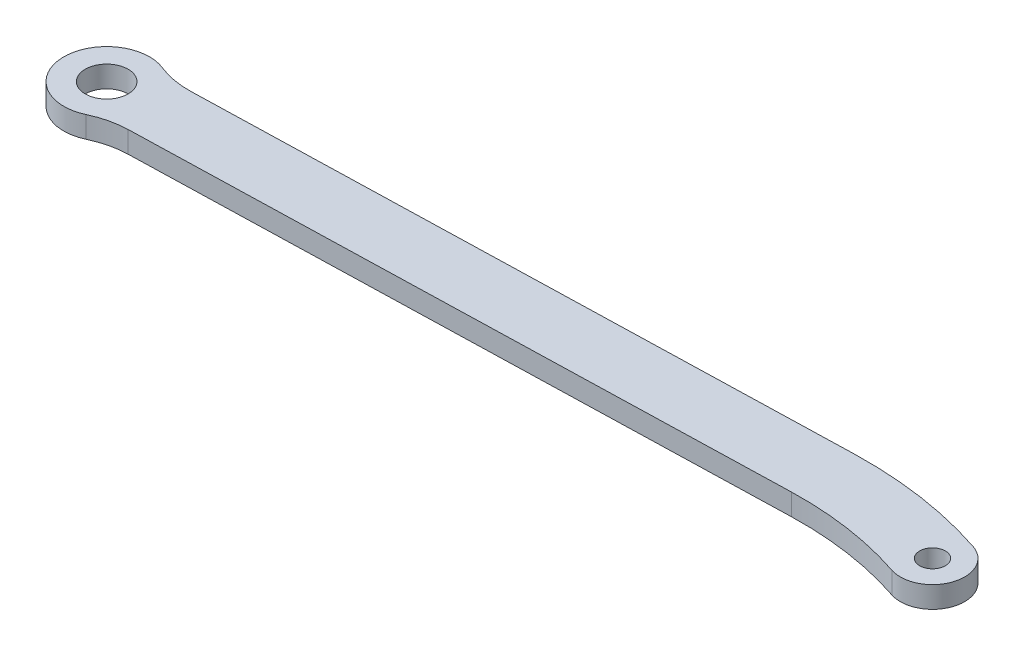
ISO-10303-21;
HEADER;
FILE_DESCRIPTION(('STEP AP214'),'2;1');
FILE_NAME('part.step','',(''),(''),'','','');
FILE_SCHEMA(('AUTOMOTIVE_DESIGN { 1 0 10303 214 1 1 1 1 }'));
ENDSEC;
DATA;
#1=APPLICATION_CONTEXT('core data for automotive mechanical design processes');
#2=APPLICATION_PROTOCOL_DEFINITION('international standard','automotive_design',2000,#1);
#3=PRODUCT_CONTEXT('',#1,'mechanical');
#4=PRODUCT('Part','Part','',(#3));
#5=PRODUCT_RELATED_PRODUCT_CATEGORY('part','',(#4));
#6=PRODUCT_DEFINITION_FORMATION('','',#4);
#7=PRODUCT_DEFINITION_CONTEXT('part definition',#1,'design');
#8=PRODUCT_DEFINITION('design','',#6,#7);
#9=PRODUCT_DEFINITION_SHAPE('','',#8);
#10=(LENGTH_UNIT() NAMED_UNIT(*) SI_UNIT(.MILLI.,.METRE.));
#11=(NAMED_UNIT(*) PLANE_ANGLE_UNIT() SI_UNIT($,.RADIAN.));
#12=(NAMED_UNIT(*) SI_UNIT($,.STERADIAN.) SOLID_ANGLE_UNIT());
#13=UNCERTAINTY_MEASURE_WITH_UNIT(LENGTH_MEASURE(1.E-05),#10,'distance_accuracy_value','');
#14=(GEOMETRIC_REPRESENTATION_CONTEXT(3) GLOBAL_UNCERTAINTY_ASSIGNED_CONTEXT((#13)) GLOBAL_UNIT_ASSIGNED_CONTEXT((#10,
#11,#12)) REPRESENTATION_CONTEXT('',''));
#15=CARTESIAN_POINT('',(0.,0.,0.));
#16=DIRECTION('',(0.,0.,1.));
#17=DIRECTION('',(1.,0.,0.));
#18=AXIS2_PLACEMENT_3D('',#15,#16,#17);
#19=CARTESIAN_POINT('',(-61.11875,3.175,0.));
#20=DIRECTION('',(0.,-1.,0.));
#21=DIRECTION('',(0.,0.,-1.));
#22=AXIS2_PLACEMENT_3D('',#19,#20,#21);
#23=CYLINDRICAL_SURFACE('',#22,3.175);
#24=CARTESIAN_POINT('',(-61.11875,3.175,0.));
#25=DIRECTION('',(0.,1.,0.));
#26=DIRECTION('',(0.,0.,1.));
#27=AXIS2_PLACEMENT_3D('',#24,#25,#26);
#28=CIRCLE('',#27,3.175);
#29=CARTESIAN_POINT('',(-61.11875,3.175,3.175));
#30=VERTEX_POINT('',#29);
#31=EDGE_CURVE('E185',#30,#30,#28,.T.);
#32=ORIENTED_EDGE('',*,*,#31,.T.);
#33=EDGE_LOOP('',(#32));
#34=FACE_BOUND('',#33,.T.);
#35=CARTESIAN_POINT('',(-61.11875,0.,0.));
#36=DIRECTION('',(0.,1.,0.));
#37=DIRECTION('',(0.,0.,1.));
#38=AXIS2_PLACEMENT_3D('',#35,#36,#37);
#39=CIRCLE('',#38,3.175);
#40=CARTESIAN_POINT('',(-61.11875,0.,3.175));
#41=VERTEX_POINT('',#40);
#42=EDGE_CURVE('E204',#41,#41,#39,.T.);
#43=ORIENTED_EDGE('',*,*,#42,.F.);
#44=EDGE_LOOP('',(#43));
#45=FACE_BOUND('',#44,.T.);
#46=ADVANCED_FACE('F83',(#34,#45),#23,.F.);
#47=CARTESIAN_POINT('',(0.,0.,0.));
#48=DIRECTION('',(0.,1.,0.));
#49=DIRECTION('',(0.,0.,1.));
#50=AXIS2_PLACEMENT_3D('',#47,#48,#49);
#51=PLANE('',#50);
#52=CARTESIAN_POINT('',(-61.11875,0.,0.));
#53=DIRECTION('',(0.,1.,0.));
#54=DIRECTION('',(0.,0.,1.));
#55=AXIS2_PLACEMENT_3D('',#52,#53,#54);
#56=CIRCLE('',#55,6.35);
#57=CARTESIAN_POINT('',(-58.7414727750302,0.,-5.88821305623701));
#58=VERTEX_POINT('',#57);
#59=CARTESIAN_POINT('',(-58.422346226689,0.,5.74907876892239));
#60=VERTEX_POINT('',#59);
#61=EDGE_CURVE('E213',#58,#60,#56,.T.);
#62=ORIENTED_EDGE('',*,*,#61,.F.);
#63=CARTESIAN_POINT('',(-53.9869183250906,0.,-17.664639168711));
#64=DIRECTION('',(0.,1.,0.));
#65=DIRECTION('',(0.,0.,1.));
#66=AXIS2_PLACEMENT_3D('',#63,#64,#65);
#67=CIRCLE('',#66,12.7);
#68=CARTESIAN_POINT('',(-53.6387802723548,0.,-4.9694117230826));
#69=VERTEX_POINT('',#68);
#70=EDGE_CURVE('E12',#58,#69,#67,.T.);
#71=ORIENTED_EDGE('',*,*,#70,.T.);
#72=DIRECTION('',(0.999624208317199,0.,-0.0274124450973135));
#73=VECTOR('',#72,1.);
#74=CARTESIAN_POINT('',(-0.176478974449826,0.,-6.4354950641133));
#75=LINE('',#74,#73);
#76=CARTESIAN_POINT('',(41.8999909624138,0.,-7.58934759433037));
#77=VERTEX_POINT('',#76);
#78=EDGE_CURVE('E189',#69,#77,#75,.T.);
#79=ORIENTED_EDGE('',*,*,#78,.T.);
#80=CARTESIAN_POINT('',(43.5536467129092,0.,52.7129827724047));
#81=DIRECTION('',(0.,1.,0.));
#82=DIRECTION('',(0.,0.,1.));
#83=AXIS2_PLACEMENT_3D('',#80,#81,#82);
#84=CIRCLE('',#83,60.325);
#85=CARTESIAN_POINT('',(62.6243302817506,0.,-4.51825566620612));
#86=VERTEX_POINT('',#85);
#87=EDGE_CURVE('E198',#77,#86,#84,.F.);
#88=ORIENTED_EDGE('',*,*,#87,.T.);
#89=CARTESIAN_POINT('',(61.11875,0.,0.));
#90=DIRECTION('',(0.,1.,0.));
#91=DIRECTION('',(0.,0.,1.));
#92=AXIS2_PLACEMENT_3D('',#89,#90,#91);
#93=CIRCLE('',#92,4.7625);
#94=CARTESIAN_POINT('',(59.6131697182494,0.,4.51825566620612));
#95=VERTEX_POINT('',#94);
#96=EDGE_CURVE('E195',#86,#95,#93,.F.);
#97=ORIENTED_EDGE('',*,*,#96,.T.);
#98=CARTESIAN_POINT('',(43.5536467129092,0.,52.7129827724047));
#99=DIRECTION('',(0.,1.,0.));
#100=DIRECTION('',(0.,0.,1.));
#101=AXIS2_PLACEMENT_3D('',#98,#99,#100);
#102=CIRCLE('',#101,50.8);
#103=CARTESIAN_POINT('',(42.1610945019657,0.,1.93207298989095));
#104=VERTEX_POINT('',#103);
#105=EDGE_CURVE('E193',#104,#95,#102,.F.);
#106=ORIENTED_EDGE('',*,*,#105,.F.);
#107=DIRECTION('',(0.999624208317199,0.,-0.0274124450973136));
#108=VECTOR('',#107,1.);
#109=CARTESIAN_POINT('',(0.0846245651020861,0.,3.08592552010803));
#110=LINE('',#109,#108);
#111=CARTESIAN_POINT('',(-53.3776767328028,0.,4.55200886113873));
#112=VERTEX_POINT('',#111);
#113=EDGE_CURVE('E165',#112,#104,#110,.T.);
#114=ORIENTED_EDGE('',*,*,#113,.F.);
#115=CARTESIAN_POINT('',(-53.029538680067,0.,17.2472363067672));
#116=DIRECTION('',(0.,1.,0.));
#117=DIRECTION('',(0.,0.,1.));
#118=AXIS2_PLACEMENT_3D('',#115,#116,#117);
#119=CIRCLE('',#118,12.7);
#120=EDGE_CURVE('E225',#112,#60,#119,.T.);
#121=ORIENTED_EDGE('',*,*,#120,.T.);
#122=EDGE_LOOP('',(#62,#71,#79,#88,#97,#106,#114,#121));
#123=FACE_BOUND('',#122,.T.);
#124=ORIENTED_EDGE('',*,*,#42,.T.);
#125=EDGE_LOOP('',(#124));
#126=FACE_BOUND('',#125,.T.);
#127=CARTESIAN_POINT('',(61.11875,0.,0.));
#128=DIRECTION('',(0.,1.,0.));
#129=DIRECTION('',(0.,0.,1.));
#130=AXIS2_PLACEMENT_3D('',#127,#128,#129);
#131=CIRCLE('',#130,1.90500000000001);
#132=CARTESIAN_POINT('',(61.11875,0.,1.90500000000002));
#133=VERTEX_POINT('',#132);
#134=EDGE_CURVE('E201',#133,#133,#131,.T.);
#135=ORIENTED_EDGE('',*,*,#134,.T.);
#136=EDGE_LOOP('',(#135));
#137=FACE_BOUND('',#136,.T.);
#138=ADVANCED_FACE('F235',(#123,#126,#137),#51,.F.);
#139=CARTESIAN_POINT('',(0.,3.175,0.));
#140=DIRECTION('',(0.,1.,0.));
#141=DIRECTION('',(0.,0.,1.));
#142=AXIS2_PLACEMENT_3D('',#139,#140,#141);
#143=PLANE('',#142);
#144=DIRECTION('',(0.999624208317199,0.,-0.0274124450973135));
#145=VECTOR('',#144,1.);
#146=CARTESIAN_POINT('',(-0.176478974449826,3.175,-6.4354950641133));
#147=LINE('',#146,#145);
#148=CARTESIAN_POINT('',(-53.6387802723548,3.175,-4.9694117230826));
#149=VERTEX_POINT('',#148);
#150=CARTESIAN_POINT('',(41.8999909624138,3.175,-7.58934759433037));
#151=VERTEX_POINT('',#150);
#152=EDGE_CURVE('E159',#149,#151,#147,.T.);
#153=ORIENTED_EDGE('',*,*,#152,.F.);
#154=CARTESIAN_POINT('',(-53.9869183250906,3.175,-17.664639168711));
#155=DIRECTION('',(0.,1.,0.));
#156=DIRECTION('',(0.,0.,1.));
#157=AXIS2_PLACEMENT_3D('',#154,#155,#156);
#158=CIRCLE('',#157,12.7);
#159=CARTESIAN_POINT('',(-58.7414727750302,3.175,-5.88821305623701));
#160=VERTEX_POINT('',#159);
#161=EDGE_CURVE('E91',#149,#160,#158,.F.);
#162=ORIENTED_EDGE('',*,*,#161,.T.);
#163=CARTESIAN_POINT('',(-61.11875,3.175,0.));
#164=DIRECTION('',(0.,1.,0.));
#165=DIRECTION('',(0.,0.,1.));
#166=AXIS2_PLACEMENT_3D('',#163,#164,#165);
#167=CIRCLE('',#166,6.35);
#168=CARTESIAN_POINT('',(-58.422346226689,3.175,5.74907876892239));
#169=VERTEX_POINT('',#168);
#170=EDGE_CURVE('E191',#160,#169,#167,.T.);
#171=ORIENTED_EDGE('',*,*,#170,.T.);
#172=CARTESIAN_POINT('',(-53.029538680067,3.175,17.2472363067672));
#173=DIRECTION('',(0.,1.,0.));
#174=DIRECTION('',(0.,0.,1.));
#175=AXIS2_PLACEMENT_3D('',#172,#173,#174);
#176=CIRCLE('',#175,12.7);
#177=CARTESIAN_POINT('',(-53.3776767328028,3.175,4.55200886113873));
#178=VERTEX_POINT('',#177);
#179=EDGE_CURVE('E156',#169,#178,#176,.F.);
#180=ORIENTED_EDGE('',*,*,#179,.T.);
#181=DIRECTION('',(0.999624208317199,0.,-0.0274124450973136));
#182=VECTOR('',#181,1.);
#183=CARTESIAN_POINT('',(0.0846245651020861,3.175,3.08592552010803));
#184=LINE('',#183,#182);
#185=CARTESIAN_POINT('',(42.1610945019657,3.175,1.93207298989095));
#186=VERTEX_POINT('',#185);
#187=EDGE_CURVE('E146',#178,#186,#184,.T.);
#188=ORIENTED_EDGE('',*,*,#187,.T.);
#189=CARTESIAN_POINT('',(43.5536467129092,3.175,52.7129827724047));
#190=DIRECTION('',(0.,1.,0.));
#191=DIRECTION('',(0.,0.,1.));
#192=AXIS2_PLACEMENT_3D('',#189,#190,#191);
#193=CIRCLE('',#192,50.8);
#194=CARTESIAN_POINT('',(59.6131697182494,3.175,4.51825566620612));
#195=VERTEX_POINT('',#194);
#196=EDGE_CURVE('E153',#186,#195,#193,.F.);
#197=ORIENTED_EDGE('',*,*,#196,.T.);
#198=CARTESIAN_POINT('',(61.11875,3.175,0.));
#199=DIRECTION('',(0.,1.,0.));
#200=DIRECTION('',(0.,0.,1.));
#201=AXIS2_PLACEMENT_3D('',#198,#199,#200);
#202=CIRCLE('',#201,4.7625);
#203=CARTESIAN_POINT('',(62.6243302817506,3.175,-4.51825566620612));
#204=VERTEX_POINT('',#203);
#205=EDGE_CURVE('E174',#204,#195,#202,.F.);
#206=ORIENTED_EDGE('',*,*,#205,.F.);
#207=CARTESIAN_POINT('',(43.5536467129092,3.175,52.7129827724047));
#208=DIRECTION('',(0.,1.,0.));
#209=DIRECTION('',(0.,0.,1.));
#210=AXIS2_PLACEMENT_3D('',#207,#208,#209);
#211=CIRCLE('',#210,60.325);
#212=EDGE_CURVE('E176',#151,#204,#211,.F.);
#213=ORIENTED_EDGE('',*,*,#212,.F.);
#214=EDGE_LOOP('',(#153,#162,#171,#180,#188,#197,#206,#213));
#215=FACE_BOUND('',#214,.T.);
#216=ORIENTED_EDGE('',*,*,#31,.F.);
#217=EDGE_LOOP('',(#216));
#218=FACE_BOUND('',#217,.T.);
#219=CARTESIAN_POINT('',(61.11875,3.175,0.));
#220=DIRECTION('',(0.,1.,0.));
#221=DIRECTION('',(0.,0.,1.));
#222=AXIS2_PLACEMENT_3D('',#219,#220,#221);
#223=CIRCLE('',#222,1.90500000000001);
#224=CARTESIAN_POINT('',(61.11875,3.175,1.90500000000002));
#225=VERTEX_POINT('',#224);
#226=EDGE_CURVE('E182',#225,#225,#223,.T.);
#227=ORIENTED_EDGE('',*,*,#226,.F.);
#228=EDGE_LOOP('',(#227));
#229=FACE_BOUND('',#228,.T.);
#230=ADVANCED_FACE('F149',(#215,#218,#229),#143,.T.);
#231=CARTESIAN_POINT('',(0.0846245651020861,3.175,3.08592552010803));
#232=DIRECTION('',(-0.0274124450973136,0.,-0.999624208317199));
#233=DIRECTION('',(-0.999624208317199,0.,0.0274124450973136));
#234=AXIS2_PLACEMENT_3D('',#231,#232,#233);
#235=PLANE('',#234);
#236=ORIENTED_EDGE('',*,*,#187,.F.);
#237=DIRECTION('',(0.,1.,0.));
#238=VECTOR('',#237,1.);
#239=CARTESIAN_POINT('',(-53.3776767328028,0.,4.55200886113873));
#240=LINE('',#239,#238);
#241=EDGE_CURVE('E220',#178,#112,#240,.F.);
#242=ORIENTED_EDGE('',*,*,#241,.T.);
#243=ORIENTED_EDGE('',*,*,#113,.T.);
#244=DIRECTION('',(0.,-1.,0.));
#245=VECTOR('',#244,1.);
#246=CARTESIAN_POINT('',(42.1610945019657,3.175,1.93207298989095));
#247=LINE('',#246,#245);
#248=EDGE_CURVE('E162',#186,#104,#247,.T.);
#249=ORIENTED_EDGE('',*,*,#248,.F.);
#250=EDGE_LOOP('',(#236,#242,#243,#249));
#251=FACE_BOUND('',#250,.T.);
#252=ADVANCED_FACE('F163',(#251),#235,.F.);
#253=CARTESIAN_POINT('',(43.5536467129092,3.175,52.7129827724047));
#254=DIRECTION('',(0.,-1.,0.));
#255=DIRECTION('',(0.,0.,-1.));
#256=AXIS2_PLACEMENT_3D('',#253,#254,#255);
#257=CYLINDRICAL_SURFACE('',#256,50.8);
#258=ORIENTED_EDGE('',*,*,#105,.T.);
#259=DIRECTION('',(0.,-1.,0.));
#260=VECTOR('',#259,1.);
#261=CARTESIAN_POINT('',(59.6131697182494,3.175,4.51825566620612));
#262=LINE('',#261,#260);
#263=EDGE_CURVE('E170',#195,#95,#262,.T.);
#264=ORIENTED_EDGE('',*,*,#263,.F.);
#265=ORIENTED_EDGE('',*,*,#196,.F.);
#266=ORIENTED_EDGE('',*,*,#248,.T.);
#267=EDGE_LOOP('',(#258,#264,#265,#266));
#268=FACE_BOUND('',#267,.T.);
#269=ADVANCED_FACE('F172',(#268),#257,.F.);
#270=CARTESIAN_POINT('',(61.11875,3.175,0.));
#271=DIRECTION('',(0.,-1.,0.));
#272=DIRECTION('',(0.,0.,-1.));
#273=AXIS2_PLACEMENT_3D('',#270,#271,#272);
#274=CYLINDRICAL_SURFACE('',#273,4.7625);
#275=ORIENTED_EDGE('',*,*,#96,.F.);
#276=DIRECTION('',(0.,-1.,0.));
#277=VECTOR('',#276,1.);
#278=CARTESIAN_POINT('',(62.6243302817506,3.175,-4.51825566620612));
#279=LINE('',#278,#277);
#280=EDGE_CURVE('E209',#204,#86,#279,.T.);
#281=ORIENTED_EDGE('',*,*,#280,.F.);
#282=ORIENTED_EDGE('',*,*,#205,.T.);
#283=ORIENTED_EDGE('',*,*,#263,.T.);
#284=EDGE_LOOP('',(#275,#281,#282,#283));
#285=FACE_BOUND('',#284,.T.);
#286=ADVANCED_FACE('F241',(#285),#274,.T.);
#287=CARTESIAN_POINT('',(43.5536467129092,3.175,52.7129827724047));
#288=DIRECTION('',(0.,-1.,0.));
#289=DIRECTION('',(0.,0.,-1.));
#290=AXIS2_PLACEMENT_3D('',#287,#288,#289);
#291=CYLINDRICAL_SURFACE('',#290,60.325);
#292=ORIENTED_EDGE('',*,*,#87,.F.);
#293=DIRECTION('',(0.,-1.,0.));
#294=VECTOR('',#293,1.);
#295=CARTESIAN_POINT('',(41.8999909624138,3.175,-7.58934759433037));
#296=LINE('',#295,#294);
#297=EDGE_CURVE('E188',#151,#77,#296,.T.);
#298=ORIENTED_EDGE('',*,*,#297,.F.);
#299=ORIENTED_EDGE('',*,*,#212,.T.);
#300=ORIENTED_EDGE('',*,*,#280,.T.);
#301=EDGE_LOOP('',(#292,#298,#299,#300));
#302=FACE_BOUND('',#301,.T.);
#303=ADVANCED_FACE('F239',(#302),#291,.T.);
#304=CARTESIAN_POINT('',(-0.176478974449826,3.175,-6.4354950641133));
#305=DIRECTION('',(-0.0274124450973135,0.,-0.999624208317199));
#306=DIRECTION('',(-0.999624208317199,0.,0.0274124450973135));
#307=AXIS2_PLACEMENT_3D('',#304,#305,#306);
#308=PLANE('',#307);
#309=ORIENTED_EDGE('',*,*,#78,.F.);
#310=DIRECTION('',(0.,-1.,0.));
#311=VECTOR('',#310,1.);
#312=CARTESIAN_POINT('',(-53.6387802723548,3.175,-4.9694117230826));
#313=LINE('',#312,#311);
#314=EDGE_CURVE('E222',#69,#149,#313,.F.);
#315=ORIENTED_EDGE('',*,*,#314,.T.);
#316=ORIENTED_EDGE('',*,*,#152,.T.);
#317=ORIENTED_EDGE('',*,*,#297,.T.);
#318=EDGE_LOOP('',(#309,#315,#316,#317));
#319=FACE_BOUND('',#318,.T.);
#320=ADVANCED_FACE('F232',(#319),#308,.T.);
#321=CARTESIAN_POINT('',(61.11875,3.175,0.));
#322=DIRECTION('',(0.,-1.,0.));
#323=DIRECTION('',(0.,0.,-1.));
#324=AXIS2_PLACEMENT_3D('',#321,#322,#323);
#325=CYLINDRICAL_SURFACE('',#324,1.90500000000001);
#326=ORIENTED_EDGE('',*,*,#226,.T.);
#327=EDGE_LOOP('',(#326));
#328=FACE_BOUND('',#327,.T.);
#329=ORIENTED_EDGE('',*,*,#134,.F.);
#330=EDGE_LOOP('',(#329));
#331=FACE_BOUND('',#330,.T.);
#332=ADVANCED_FACE('F250',(#328,#331),#325,.F.);
#333=CARTESIAN_POINT('',(-61.11875,3.175,0.));
#334=DIRECTION('',(0.,-1.,0.));
#335=DIRECTION('',(0.,0.,-1.));
#336=AXIS2_PLACEMENT_3D('',#333,#334,#335);
#337=CYLINDRICAL_SURFACE('',#336,6.35);
#338=ORIENTED_EDGE('',*,*,#61,.T.);
#339=DIRECTION('',(0.,-1.,0.));
#340=VECTOR('',#339,1.);
#341=CARTESIAN_POINT('',(-58.422346226689,3.175,5.74907876892239));
#342=LINE('',#341,#340);
#343=EDGE_CURVE('E217',#60,#169,#342,.F.);
#344=ORIENTED_EDGE('',*,*,#343,.T.);
#345=ORIENTED_EDGE('',*,*,#170,.F.);
#346=DIRECTION('',(0.,-1.,0.));
#347=VECTOR('',#346,1.);
#348=CARTESIAN_POINT('',(-58.7414727750302,3.175,-5.88821305623701));
#349=LINE('',#348,#347);
#350=EDGE_CURVE('E169',#160,#58,#349,.T.);
#351=ORIENTED_EDGE('',*,*,#350,.T.);
#352=EDGE_LOOP('',(#338,#344,#345,#351));
#353=FACE_BOUND('',#352,.T.);
#354=ADVANCED_FACE('F229',(#353),#337,.T.);
#355=CARTESIAN_POINT('',(-53.029538680067,3.175,17.2472363067672));
#356=DIRECTION('',(0.,-1.,0.));
#357=DIRECTION('',(0.,0.,-1.));
#358=AXIS2_PLACEMENT_3D('',#355,#356,#357);
#359=CYLINDRICAL_SURFACE('',#358,12.7);
#360=ORIENTED_EDGE('',*,*,#120,.F.);
#361=ORIENTED_EDGE('',*,*,#241,.F.);
#362=ORIENTED_EDGE('',*,*,#179,.F.);
#363=ORIENTED_EDGE('',*,*,#343,.F.);
#364=EDGE_LOOP('',(#360,#361,#362,#363));
#365=FACE_BOUND('',#364,.T.);
#366=ADVANCED_FACE('F244',(#365),#359,.F.);
#367=CARTESIAN_POINT('',(-53.9869183250906,3.175,-17.664639168711));
#368=DIRECTION('',(0.,-1.,0.));
#369=DIRECTION('',(0.,0.,-1.));
#370=AXIS2_PLACEMENT_3D('',#367,#368,#369);
#371=CYLINDRICAL_SURFACE('',#370,12.7);
#372=ORIENTED_EDGE('',*,*,#70,.F.);
#373=ORIENTED_EDGE('',*,*,#350,.F.);
#374=ORIENTED_EDGE('',*,*,#161,.F.);
#375=ORIENTED_EDGE('',*,*,#314,.F.);
#376=EDGE_LOOP('',(#372,#373,#374,#375));
#377=FACE_BOUND('',#376,.T.);
#378=ADVANCED_FACE('F85',(#377),#371,.F.);
#379=CLOSED_SHELL('',(#46,#138,#230,#252,#269,#286,#303,#320,#332,#354,#366,#378));
#380=MANIFOLD_SOLID_BREP('B2',#379);
#381=ADVANCED_BREP_SHAPE_REPRESENTATION('',(#18,#380),#14);
#382=SHAPE_DEFINITION_REPRESENTATION(#9,#381);
ENDSEC;
END-ISO-10303-21;
